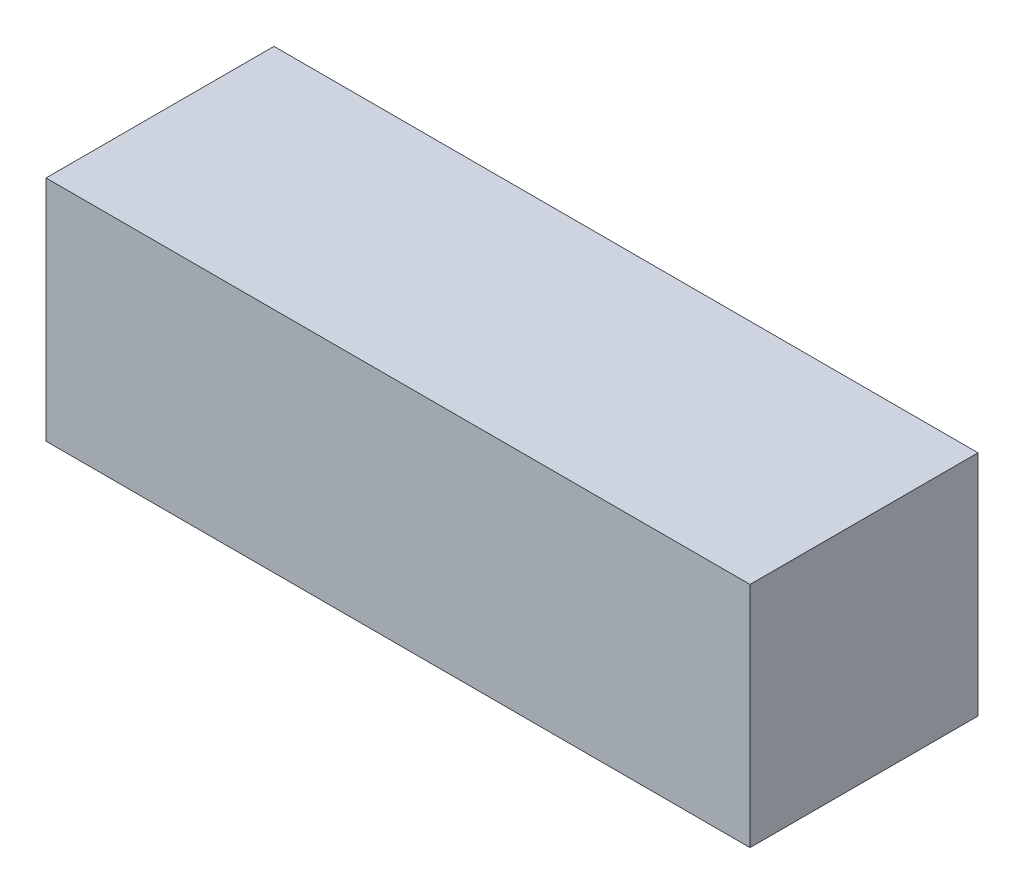
ISO-10303-21;
HEADER;
FILE_DESCRIPTION(('STEP AP214'),'2;1');
FILE_NAME('part.step','',(''),(''),'','','');
FILE_SCHEMA(('AUTOMOTIVE_DESIGN { 1 0 10303 214 1 1 1 1 }'));
ENDSEC;
DATA;
#1=APPLICATION_CONTEXT('core data for automotive mechanical design processes');
#2=APPLICATION_PROTOCOL_DEFINITION('international standard','automotive_design',2000,#1);
#3=PRODUCT_CONTEXT('',#1,'mechanical');
#4=PRODUCT('Part','Part','',(#3));
#5=PRODUCT_RELATED_PRODUCT_CATEGORY('part','',(#4));
#6=PRODUCT_DEFINITION_FORMATION('','',#4);
#7=PRODUCT_DEFINITION_CONTEXT('part definition',#1,'design');
#8=PRODUCT_DEFINITION('design','',#6,#7);
#9=PRODUCT_DEFINITION_SHAPE('','',#8);
#10=(LENGTH_UNIT() NAMED_UNIT(*) SI_UNIT(.MILLI.,.METRE.));
#11=(NAMED_UNIT(*) PLANE_ANGLE_UNIT() SI_UNIT($,.RADIAN.));
#12=(NAMED_UNIT(*) SI_UNIT($,.STERADIAN.) SOLID_ANGLE_UNIT());
#13=UNCERTAINTY_MEASURE_WITH_UNIT(LENGTH_MEASURE(1.E-05),#10,'distance_accuracy_value','');
#14=(GEOMETRIC_REPRESENTATION_CONTEXT(3) GLOBAL_UNCERTAINTY_ASSIGNED_CONTEXT((#13)) GLOBAL_UNIT_ASSIGNED_CONTEXT((#10,
#11,#12)) REPRESENTATION_CONTEXT('',''));
#15=CARTESIAN_POINT('',(0.,0.,0.));
#16=DIRECTION('',(0.,0.,1.));
#17=DIRECTION('',(1.,0.,0.));
#18=AXIS2_PLACEMENT_3D('',#15,#16,#17);
#19=CARTESIAN_POINT('',(26.67,8.636,8.636));
#20=DIRECTION('',(-1.,0.,0.));
#21=DIRECTION('',(0.,0.,1.));
#22=AXIS2_PLACEMENT_3D('',#19,#20,#21);
#23=PLANE('',#22);
#24=DIRECTION('',(0.,0.,-1.));
#25=VECTOR('',#24,1.);
#26=CARTESIAN_POINT('',(26.67,-8.636,8.636));
#27=LINE('',#26,#25);
#28=CARTESIAN_POINT('',(26.67,-8.636,8.636));
#29=VERTEX_POINT('',#28);
#30=CARTESIAN_POINT('',(26.67,-8.636,-8.636));
#31=VERTEX_POINT('',#30);
#32=EDGE_CURVE('E97',#29,#31,#27,.T.);
#33=ORIENTED_EDGE('',*,*,#32,.T.);
#34=DIRECTION('',(0.,-1.,0.));
#35=VECTOR('',#34,1.);
#36=CARTESIAN_POINT('',(26.67,8.636,-8.636));
#37=LINE('',#36,#35);
#38=CARTESIAN_POINT('',(26.67,8.636,-8.636));
#39=VERTEX_POINT('',#38);
#40=EDGE_CURVE('E11',#39,#31,#37,.T.);
#41=ORIENTED_EDGE('',*,*,#40,.F.);
#42=DIRECTION('',(0.,0.,-1.));
#43=VECTOR('',#42,1.);
#44=CARTESIAN_POINT('',(26.67,8.636,8.636));
#45=LINE('',#44,#43);
#46=CARTESIAN_POINT('',(26.67,8.636,8.636));
#47=VERTEX_POINT('',#46);
#48=EDGE_CURVE('E85',#47,#39,#45,.T.);
#49=ORIENTED_EDGE('',*,*,#48,.F.);
#50=DIRECTION('',(0.,-1.,0.));
#51=VECTOR('',#50,1.);
#52=CARTESIAN_POINT('',(26.67,8.636,8.636));
#53=LINE('',#52,#51);
#54=EDGE_CURVE('E93',#47,#29,#53,.T.);
#55=ORIENTED_EDGE('',*,*,#54,.T.);
#56=EDGE_LOOP('',(#33,#41,#49,#55));
#57=FACE_BOUND('',#56,.T.);
#58=ADVANCED_FACE('F34',(#57),#23,.F.);
#59=CARTESIAN_POINT('',(-26.67,8.636,-8.636));
#60=DIRECTION('',(0.,0.,1.));
#61=DIRECTION('',(1.,0.,0.));
#62=AXIS2_PLACEMENT_3D('',#59,#60,#61);
#63=PLANE('',#62);
#64=DIRECTION('',(-1.,0.,0.));
#65=VECTOR('',#64,1.);
#66=CARTESIAN_POINT('',(-26.67,-8.636,-8.636));
#67=LINE('',#66,#65);
#68=CARTESIAN_POINT('',(-26.67,-8.636,-8.636));
#69=VERTEX_POINT('',#68);
#70=EDGE_CURVE('E89',#31,#69,#67,.T.);
#71=ORIENTED_EDGE('',*,*,#70,.T.);
#72=DIRECTION('',(0.,-1.,0.));
#73=VECTOR('',#72,1.);
#74=CARTESIAN_POINT('',(-26.67,8.636,-8.636));
#75=LINE('',#74,#73);
#76=CARTESIAN_POINT('',(-26.67,8.636,-8.636));
#77=VERTEX_POINT('',#76);
#78=EDGE_CURVE('E42',#77,#69,#75,.T.);
#79=ORIENTED_EDGE('',*,*,#78,.F.);
#80=DIRECTION('',(-1.,0.,0.));
#81=VECTOR('',#80,1.);
#82=CARTESIAN_POINT('',(-26.67,8.636,-8.636));
#83=LINE('',#82,#81);
#84=EDGE_CURVE('E80',#39,#77,#83,.T.);
#85=ORIENTED_EDGE('',*,*,#84,.F.);
#86=ORIENTED_EDGE('',*,*,#40,.T.);
#87=EDGE_LOOP('',(#71,#79,#85,#86));
#88=FACE_BOUND('',#87,.T.);
#89=ADVANCED_FACE('F88',(#88),#63,.F.);
#90=CARTESIAN_POINT('',(-26.67,8.636,8.636));
#91=DIRECTION('',(1.,0.,0.));
#92=DIRECTION('',(0.,0.,-1.));
#93=AXIS2_PLACEMENT_3D('',#90,#91,#92);
#94=PLANE('',#93);
#95=DIRECTION('',(0.,0.,1.));
#96=VECTOR('',#95,1.);
#97=CARTESIAN_POINT('',(-26.67,-8.636,8.636));
#98=LINE('',#97,#96);
#99=CARTESIAN_POINT('',(-26.67,-8.636,8.636));
#100=VERTEX_POINT('',#99);
#101=EDGE_CURVE('E67',#69,#100,#98,.T.);
#102=ORIENTED_EDGE('',*,*,#101,.T.);
#103=DIRECTION('',(0.,-1.,0.));
#104=VECTOR('',#103,1.);
#105=CARTESIAN_POINT('',(-26.67,8.636,8.636));
#106=LINE('',#105,#104);
#107=CARTESIAN_POINT('',(-26.67,8.636,8.636));
#108=VERTEX_POINT('',#107);
#109=EDGE_CURVE('E90',#108,#100,#106,.T.);
#110=ORIENTED_EDGE('',*,*,#109,.F.);
#111=DIRECTION('',(0.,0.,1.));
#112=VECTOR('',#111,1.);
#113=CARTESIAN_POINT('',(-26.67,8.636,8.636));
#114=LINE('',#113,#112);
#115=EDGE_CURVE('E83',#77,#108,#114,.T.);
#116=ORIENTED_EDGE('',*,*,#115,.F.);
#117=ORIENTED_EDGE('',*,*,#78,.T.);
#118=EDGE_LOOP('',(#102,#110,#116,#117));
#119=FACE_BOUND('',#118,.T.);
#120=ADVANCED_FACE('F91',(#119),#94,.F.);
#121=CARTESIAN_POINT('',(-26.67,8.636,8.636));
#122=DIRECTION('',(0.,0.,-1.));
#123=DIRECTION('',(-1.,0.,0.));
#124=AXIS2_PLACEMENT_3D('',#121,#122,#123);
#125=PLANE('',#124);
#126=DIRECTION('',(1.,0.,0.));
#127=VECTOR('',#126,1.);
#128=CARTESIAN_POINT('',(-26.67,-8.636,8.636));
#129=LINE('',#128,#127);
#130=EDGE_CURVE('E73',#100,#29,#129,.T.);
#131=ORIENTED_EDGE('',*,*,#130,.T.);
#132=ORIENTED_EDGE('',*,*,#54,.F.);
#133=DIRECTION('',(1.,0.,0.));
#134=VECTOR('',#133,1.);
#135=CARTESIAN_POINT('',(-26.67,8.636,8.636));
#136=LINE('',#135,#134);
#137=EDGE_CURVE('E50',#108,#47,#136,.T.);
#138=ORIENTED_EDGE('',*,*,#137,.F.);
#139=ORIENTED_EDGE('',*,*,#109,.T.);
#140=EDGE_LOOP('',(#131,#132,#138,#139));
#141=FACE_BOUND('',#140,.T.);
#142=ADVANCED_FACE('F104',(#141),#125,.F.);
#143=CARTESIAN_POINT('',(0.,8.636,0.));
#144=DIRECTION('',(0.,-1.,0.));
#145=DIRECTION('',(0.,0.,-1.));
#146=AXIS2_PLACEMENT_3D('',#143,#144,#145);
#147=PLANE('',#146);
#148=ORIENTED_EDGE('',*,*,#48,.T.);
#149=ORIENTED_EDGE('',*,*,#84,.T.);
#150=ORIENTED_EDGE('',*,*,#115,.T.);
#151=ORIENTED_EDGE('',*,*,#137,.T.);
#152=EDGE_LOOP('',(#148,#149,#150,#151));
#153=FACE_BOUND('',#152,.T.);
#154=ADVANCED_FACE('F81',(#153),#147,.F.);
#155=CARTESIAN_POINT('',(0.,-8.636,0.));
#156=DIRECTION('',(0.,-1.,0.));
#157=DIRECTION('',(0.,0.,-1.));
#158=AXIS2_PLACEMENT_3D('',#155,#156,#157);
#159=PLANE('',#158);
#160=ORIENTED_EDGE('',*,*,#32,.F.);
#161=ORIENTED_EDGE('',*,*,#130,.F.);
#162=ORIENTED_EDGE('',*,*,#101,.F.);
#163=ORIENTED_EDGE('',*,*,#70,.F.);
#164=EDGE_LOOP('',(#160,#161,#162,#163));
#165=FACE_BOUND('',#164,.T.);
#166=ADVANCED_FACE('F107',(#165),#159,.T.);
#167=CLOSED_SHELL('',(#58,#89,#120,#142,#154,#166));
#168=MANIFOLD_SOLID_BREP('B2',#167);
#169=ADVANCED_BREP_SHAPE_REPRESENTATION('',(#18,#168),#14);
#170=SHAPE_DEFINITION_REPRESENTATION(#9,#169);
ENDSEC;
END-ISO-10303-21;
